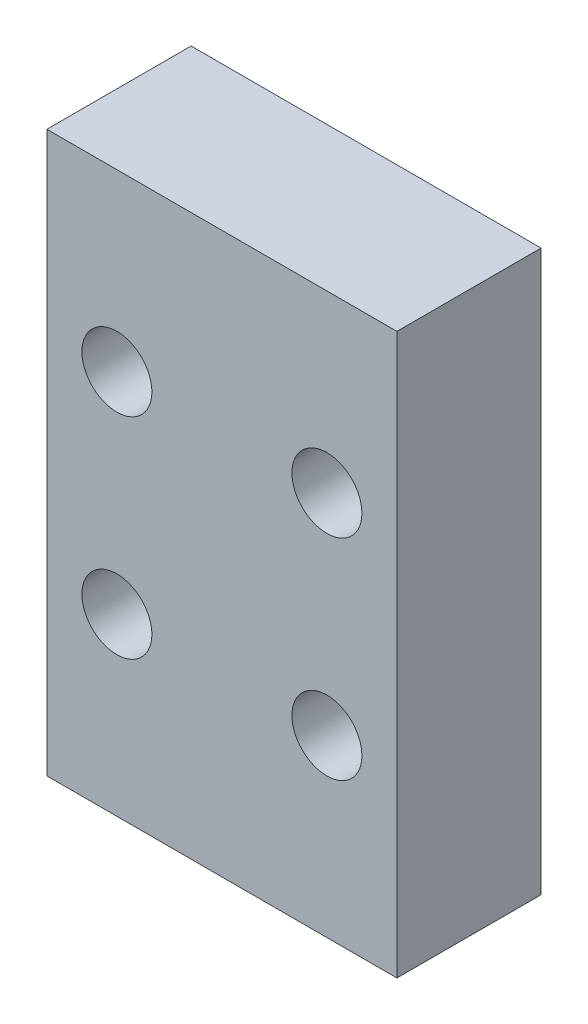
ISO-10303-21;
HEADER;
FILE_DESCRIPTION(('STEP AP214'),'2;1');
FILE_NAME('part.step','',(''),(''),'','','');
FILE_SCHEMA(('AUTOMOTIVE_DESIGN { 1 0 10303 214 1 1 1 1 }'));
ENDSEC;
DATA;
#1=APPLICATION_CONTEXT('core data for automotive mechanical design processes');
#2=APPLICATION_PROTOCOL_DEFINITION('international standard','automotive_design',2000,#1);
#3=PRODUCT_CONTEXT('',#1,'mechanical');
#4=PRODUCT('Part','Part','',(#3));
#5=PRODUCT_RELATED_PRODUCT_CATEGORY('part','',(#4));
#6=PRODUCT_DEFINITION_FORMATION('','',#4);
#7=PRODUCT_DEFINITION_CONTEXT('part definition',#1,'design');
#8=PRODUCT_DEFINITION('design','',#6,#7);
#9=PRODUCT_DEFINITION_SHAPE('','',#8);
#10=(LENGTH_UNIT() NAMED_UNIT(*) SI_UNIT(.MILLI.,.METRE.));
#11=(NAMED_UNIT(*) PLANE_ANGLE_UNIT() SI_UNIT($,.RADIAN.));
#12=(NAMED_UNIT(*) SI_UNIT($,.STERADIAN.) SOLID_ANGLE_UNIT());
#13=UNCERTAINTY_MEASURE_WITH_UNIT(LENGTH_MEASURE(1.E-05),#10,'distance_accuracy_value','');
#14=(GEOMETRIC_REPRESENTATION_CONTEXT(3) GLOBAL_UNCERTAINTY_ASSIGNED_CONTEXT((#13)) GLOBAL_UNIT_ASSIGNED_CONTEXT((#10,
#11,#12)) REPRESENTATION_CONTEXT('',''));
#15=CARTESIAN_POINT('',(0.,0.,0.));
#16=DIRECTION('',(0.,0.,1.));
#17=DIRECTION('',(1.,0.,0.));
#18=AXIS2_PLACEMENT_3D('',#15,#16,#17);
#19=CARTESIAN_POINT('',(0.,0.,13.081));
#20=DIRECTION('',(1.,0.,0.));
#21=DIRECTION('',(0.,0.,-1.));
#22=AXIS2_PLACEMENT_3D('',#19,#20,#21);
#23=PLANE('',#22);
#24=DIRECTION('',(0.,-1.,0.));
#25=VECTOR('',#24,1.);
#26=CARTESIAN_POINT('',(0.,0.,0.));
#27=LINE('',#26,#25);
#28=CARTESIAN_POINT('',(0.,50.8,0.));
#29=VERTEX_POINT('',#28);
#30=CARTESIAN_POINT('',(0.,0.,0.));
#31=VERTEX_POINT('',#30);
#32=EDGE_CURVE('E96',#29,#31,#27,.T.);
#33=ORIENTED_EDGE('',*,*,#32,.T.);
#34=DIRECTION('',(0.,0.,-1.));
#35=VECTOR('',#34,1.);
#36=CARTESIAN_POINT('',(0.,0.,13.081));
#37=LINE('',#36,#35);
#38=CARTESIAN_POINT('',(0.,0.,13.081));
#39=VERTEX_POINT('',#38);
#40=EDGE_CURVE('E11',#39,#31,#37,.T.);
#41=ORIENTED_EDGE('',*,*,#40,.F.);
#42=DIRECTION('',(0.,-1.,0.));
#43=VECTOR('',#42,1.);
#44=CARTESIAN_POINT('',(0.,0.,13.081));
#45=LINE('',#44,#43);
#46=CARTESIAN_POINT('',(0.,50.8,13.081));
#47=VERTEX_POINT('',#46);
#48=EDGE_CURVE('E84',#47,#39,#45,.T.);
#49=ORIENTED_EDGE('',*,*,#48,.F.);
#50=DIRECTION('',(0.,0.,-1.));
#51=VECTOR('',#50,1.);
#52=CARTESIAN_POINT('',(0.,50.8,13.081));
#53=LINE('',#52,#51);
#54=EDGE_CURVE('E92',#47,#29,#53,.T.);
#55=ORIENTED_EDGE('',*,*,#54,.T.);
#56=EDGE_LOOP('',(#33,#41,#49,#55));
#57=FACE_BOUND('',#56,.T.);
#58=ADVANCED_FACE('F33',(#57),#23,.F.);
#59=CARTESIAN_POINT('',(0.,0.,13.081));
#60=DIRECTION('',(0.,1.,0.));
#61=DIRECTION('',(0.,0.,1.));
#62=AXIS2_PLACEMENT_3D('',#59,#60,#61);
#63=PLANE('',#62);
#64=DIRECTION('',(1.,0.,0.));
#65=VECTOR('',#64,1.);
#66=CARTESIAN_POINT('',(0.,0.,0.));
#67=LINE('',#66,#65);
#68=CARTESIAN_POINT('',(31.75,0.,0.));
#69=VERTEX_POINT('',#68);
#70=EDGE_CURVE('E88',#31,#69,#67,.T.);
#71=ORIENTED_EDGE('',*,*,#70,.T.);
#72=DIRECTION('',(0.,0.,-1.));
#73=VECTOR('',#72,1.);
#74=CARTESIAN_POINT('',(31.75,0.,13.081));
#75=LINE('',#74,#73);
#76=CARTESIAN_POINT('',(31.75,0.,13.081));
#77=VERTEX_POINT('',#76);
#78=EDGE_CURVE('E41',#77,#69,#75,.T.);
#79=ORIENTED_EDGE('',*,*,#78,.F.);
#80=DIRECTION('',(1.,0.,0.));
#81=VECTOR('',#80,1.);
#82=CARTESIAN_POINT('',(0.,0.,13.081));
#83=LINE('',#82,#81);
#84=EDGE_CURVE('E79',#39,#77,#83,.T.);
#85=ORIENTED_EDGE('',*,*,#84,.F.);
#86=ORIENTED_EDGE('',*,*,#40,.T.);
#87=EDGE_LOOP('',(#71,#79,#85,#86));
#88=FACE_BOUND('',#87,.T.);
#89=ADVANCED_FACE('F87',(#88),#63,.F.);
#90=CARTESIAN_POINT('',(31.75,0.,13.081));
#91=DIRECTION('',(-1.,0.,0.));
#92=DIRECTION('',(0.,0.,1.));
#93=AXIS2_PLACEMENT_3D('',#90,#91,#92);
#94=PLANE('',#93);
#95=DIRECTION('',(0.,1.,0.));
#96=VECTOR('',#95,1.);
#97=CARTESIAN_POINT('',(31.75,0.,0.));
#98=LINE('',#97,#96);
#99=CARTESIAN_POINT('',(31.75,50.8,0.));
#100=VERTEX_POINT('',#99);
#101=EDGE_CURVE('E66',#69,#100,#98,.T.);
#102=ORIENTED_EDGE('',*,*,#101,.T.);
#103=DIRECTION('',(0.,0.,-1.));
#104=VECTOR('',#103,1.);
#105=CARTESIAN_POINT('',(31.75,50.8,13.081));
#106=LINE('',#105,#104);
#107=CARTESIAN_POINT('',(31.75,50.8,13.081));
#108=VERTEX_POINT('',#107);
#109=EDGE_CURVE('E89',#108,#100,#106,.T.);
#110=ORIENTED_EDGE('',*,*,#109,.F.);
#111=DIRECTION('',(0.,1.,0.));
#112=VECTOR('',#111,1.);
#113=CARTESIAN_POINT('',(31.75,0.,13.081));
#114=LINE('',#113,#112);
#115=EDGE_CURVE('E82',#77,#108,#114,.T.);
#116=ORIENTED_EDGE('',*,*,#115,.F.);
#117=ORIENTED_EDGE('',*,*,#78,.T.);
#118=EDGE_LOOP('',(#102,#110,#116,#117));
#119=FACE_BOUND('',#118,.T.);
#120=ADVANCED_FACE('F90',(#119),#94,.F.);
#121=CARTESIAN_POINT('',(0.,50.8,13.081));
#122=DIRECTION('',(0.,-1.,0.));
#123=DIRECTION('',(0.,0.,-1.));
#124=AXIS2_PLACEMENT_3D('',#121,#122,#123);
#125=PLANE('',#124);
#126=DIRECTION('',(-1.,0.,0.));
#127=VECTOR('',#126,1.);
#128=CARTESIAN_POINT('',(0.,50.8,0.));
#129=LINE('',#128,#127);
#130=EDGE_CURVE('E72',#100,#29,#129,.T.);
#131=ORIENTED_EDGE('',*,*,#130,.T.);
#132=ORIENTED_EDGE('',*,*,#54,.F.);
#133=DIRECTION('',(-1.,0.,0.));
#134=VECTOR('',#133,1.);
#135=CARTESIAN_POINT('',(0.,50.8,13.081));
#136=LINE('',#135,#134);
#137=EDGE_CURVE('E49',#108,#47,#136,.T.);
#138=ORIENTED_EDGE('',*,*,#137,.F.);
#139=ORIENTED_EDGE('',*,*,#109,.T.);
#140=EDGE_LOOP('',(#131,#132,#138,#139));
#141=FACE_BOUND('',#140,.T.);
#142=ADVANCED_FACE('F104',(#141),#125,.F.);
#143=CARTESIAN_POINT('',(0.,0.,13.081));
#144=DIRECTION('',(0.,0.,-1.));
#145=DIRECTION('',(-1.,0.,0.));
#146=AXIS2_PLACEMENT_3D('',#143,#144,#145);
#147=PLANE('',#146);
#148=CARTESIAN_POINT('',(25.4,15.875,13.081));
#149=DIRECTION('',(0.,0.,1.));
#150=DIRECTION('',(1.,0.,0.));
#151=AXIS2_PLACEMENT_3D('',#148,#149,#150);
#152=CIRCLE('',#151,3.175);
#153=CARTESIAN_POINT('',(28.575,15.875,13.081));
#154=VERTEX_POINT('',#153);
#155=EDGE_CURVE('E119',#154,#154,#152,.T.);
#156=ORIENTED_EDGE('',*,*,#155,.F.);
#157=EDGE_LOOP('',(#156));
#158=FACE_BOUND('',#157,.T.);
#159=CARTESIAN_POINT('',(6.35,15.875,13.081));
#160=DIRECTION('',(0.,0.,1.));
#161=DIRECTION('',(1.,0.,0.));
#162=AXIS2_PLACEMENT_3D('',#159,#160,#161);
#163=CIRCLE('',#162,3.175);
#164=CARTESIAN_POINT('',(9.525,15.875,13.081));
#165=VERTEX_POINT('',#164);
#166=EDGE_CURVE('E125',#165,#165,#163,.T.);
#167=ORIENTED_EDGE('',*,*,#166,.F.);
#168=EDGE_LOOP('',(#167));
#169=FACE_BOUND('',#168,.T.);
#170=CARTESIAN_POINT('',(6.35,34.925,13.081));
#171=DIRECTION('',(0.,0.,1.));
#172=DIRECTION('',(1.,0.,0.));
#173=AXIS2_PLACEMENT_3D('',#170,#171,#172);
#174=CIRCLE('',#173,3.175);
#175=CARTESIAN_POINT('',(9.525,34.925,13.081));
#176=VERTEX_POINT('',#175);
#177=EDGE_CURVE('E113',#176,#176,#174,.T.);
#178=ORIENTED_EDGE('',*,*,#177,.F.);
#179=EDGE_LOOP('',(#178));
#180=FACE_BOUND('',#179,.T.);
#181=CARTESIAN_POINT('',(25.4,34.925,13.081));
#182=DIRECTION('',(0.,0.,1.));
#183=DIRECTION('',(1.,0.,0.));
#184=AXIS2_PLACEMENT_3D('',#181,#182,#183);
#185=CIRCLE('',#184,3.175);
#186=CARTESIAN_POINT('',(28.575,34.925,13.081));
#187=VERTEX_POINT('',#186);
#188=EDGE_CURVE('E99',#187,#187,#185,.T.);
#189=ORIENTED_EDGE('',*,*,#188,.F.);
#190=EDGE_LOOP('',(#189));
#191=FACE_BOUND('',#190,.T.);
#192=ORIENTED_EDGE('',*,*,#48,.T.);
#193=ORIENTED_EDGE('',*,*,#84,.T.);
#194=ORIENTED_EDGE('',*,*,#115,.T.);
#195=ORIENTED_EDGE('',*,*,#137,.T.);
#196=EDGE_LOOP('',(#192,#193,#194,#195));
#197=FACE_BOUND('',#196,.T.);
#198=ADVANCED_FACE('F80',(#158,#169,#180,#191,#197),#147,.F.);
#199=CARTESIAN_POINT('',(0.,0.,0.));
#200=DIRECTION('',(0.,0.,-1.));
#201=DIRECTION('',(-1.,0.,0.));
#202=AXIS2_PLACEMENT_3D('',#199,#200,#201);
#203=PLANE('',#202);
#204=CARTESIAN_POINT('',(25.4,15.875,0.));
#205=DIRECTION('',(0.,0.,-1.));
#206=DIRECTION('',(-1.,0.,0.));
#207=AXIS2_PLACEMENT_3D('',#204,#205,#206);
#208=CIRCLE('',#207,3.175);
#209=CARTESIAN_POINT('',(22.225,15.875,0.));
#210=VERTEX_POINT('',#209);
#211=EDGE_CURVE('E116',#210,#210,#208,.F.);
#212=ORIENTED_EDGE('',*,*,#211,.T.);
#213=EDGE_LOOP('',(#212));
#214=FACE_BOUND('',#213,.T.);
#215=CARTESIAN_POINT('',(6.35,15.875,0.));
#216=DIRECTION('',(0.,0.,-1.));
#217=DIRECTION('',(-1.,0.,0.));
#218=AXIS2_PLACEMENT_3D('',#215,#216,#217);
#219=CIRCLE('',#218,3.175);
#220=CARTESIAN_POINT('',(3.17499999999999,15.875,0.));
#221=VERTEX_POINT('',#220);
#222=EDGE_CURVE('E122',#221,#221,#219,.F.);
#223=ORIENTED_EDGE('',*,*,#222,.T.);
#224=EDGE_LOOP('',(#223));
#225=FACE_BOUND('',#224,.T.);
#226=CARTESIAN_POINT('',(6.35,34.925,0.));
#227=DIRECTION('',(0.,0.,-1.));
#228=DIRECTION('',(-1.,0.,0.));
#229=AXIS2_PLACEMENT_3D('',#226,#227,#228);
#230=CIRCLE('',#229,3.175);
#231=CARTESIAN_POINT('',(3.175,34.925,0.));
#232=VERTEX_POINT('',#231);
#233=EDGE_CURVE('E128',#232,#232,#230,.F.);
#234=ORIENTED_EDGE('',*,*,#233,.T.);
#235=EDGE_LOOP('',(#234));
#236=FACE_BOUND('',#235,.T.);
#237=CARTESIAN_POINT('',(25.4,34.925,0.));
#238=DIRECTION('',(0.,0.,-1.));
#239=DIRECTION('',(-1.,0.,0.));
#240=AXIS2_PLACEMENT_3D('',#237,#238,#239);
#241=CIRCLE('',#240,3.175);
#242=CARTESIAN_POINT('',(22.225,34.925,0.));
#243=VERTEX_POINT('',#242);
#244=EDGE_CURVE('E110',#243,#243,#241,.F.);
#245=ORIENTED_EDGE('',*,*,#244,.T.);
#246=EDGE_LOOP('',(#245));
#247=FACE_BOUND('',#246,.T.);
#248=ORIENTED_EDGE('',*,*,#32,.F.);
#249=ORIENTED_EDGE('',*,*,#130,.F.);
#250=ORIENTED_EDGE('',*,*,#101,.F.);
#251=ORIENTED_EDGE('',*,*,#70,.F.);
#252=EDGE_LOOP('',(#248,#249,#250,#251));
#253=FACE_BOUND('',#252,.T.);
#254=ADVANCED_FACE('F107',(#214,#225,#236,#247,#253),#203,.T.);
#255=CARTESIAN_POINT('',(25.4,34.925,-0.000999999999999265));
#256=DIRECTION('',(0.,0.,1.));
#257=DIRECTION('',(1.,0.,0.));
#258=AXIS2_PLACEMENT_3D('',#255,#256,#257);
#259=CYLINDRICAL_SURFACE('',#258,3.175);
#260=ORIENTED_EDGE('',*,*,#244,.F.);
#261=EDGE_LOOP('',(#260));
#262=FACE_BOUND('',#261,.T.);
#263=ORIENTED_EDGE('',*,*,#188,.T.);
#264=EDGE_LOOP('',(#263));
#265=FACE_BOUND('',#264,.T.);
#266=ADVANCED_FACE('F142',(#262,#265),#259,.F.);
#267=CARTESIAN_POINT('',(6.35,34.925,-0.000999999999999265));
#268=DIRECTION('',(0.,0.,1.));
#269=DIRECTION('',(1.,0.,0.));
#270=AXIS2_PLACEMENT_3D('',#267,#268,#269);
#271=CYLINDRICAL_SURFACE('',#270,3.175);
#272=ORIENTED_EDGE('',*,*,#233,.F.);
#273=EDGE_LOOP('',(#272));
#274=FACE_BOUND('',#273,.T.);
#275=ORIENTED_EDGE('',*,*,#177,.T.);
#276=EDGE_LOOP('',(#275));
#277=FACE_BOUND('',#276,.T.);
#278=ADVANCED_FACE('F134',(#274,#277),#271,.F.);
#279=CARTESIAN_POINT('',(6.35,15.875,-0.000999999999999265));
#280=DIRECTION('',(0.,0.,1.));
#281=DIRECTION('',(1.,0.,0.));
#282=AXIS2_PLACEMENT_3D('',#279,#280,#281);
#283=CYLINDRICAL_SURFACE('',#282,3.175);
#284=ORIENTED_EDGE('',*,*,#222,.F.);
#285=EDGE_LOOP('',(#284));
#286=FACE_BOUND('',#285,.T.);
#287=ORIENTED_EDGE('',*,*,#166,.T.);
#288=EDGE_LOOP('',(#287));
#289=FACE_BOUND('',#288,.T.);
#290=ADVANCED_FACE('F150',(#286,#289),#283,.F.);
#291=CARTESIAN_POINT('',(25.4,15.875,-0.000999999999999265));
#292=DIRECTION('',(0.,0.,1.));
#293=DIRECTION('',(1.,0.,0.));
#294=AXIS2_PLACEMENT_3D('',#291,#292,#293);
#295=CYLINDRICAL_SURFACE('',#294,3.175);
#296=ORIENTED_EDGE('',*,*,#211,.F.);
#297=EDGE_LOOP('',(#296));
#298=FACE_BOUND('',#297,.T.);
#299=ORIENTED_EDGE('',*,*,#155,.T.);
#300=EDGE_LOOP('',(#299));
#301=FACE_BOUND('',#300,.T.);
#302=ADVANCED_FACE('F198',(#298,#301),#295,.F.);
#303=CLOSED_SHELL('',(#58,#89,#120,#142,#198,#254,#266,#278,#290,#302));
#304=MANIFOLD_SOLID_BREP('B2',#303);
#305=ADVANCED_BREP_SHAPE_REPRESENTATION('',(#18,#304),#14);
#306=SHAPE_DEFINITION_REPRESENTATION(#9,#305);
ENDSEC;
END-ISO-10303-21;
